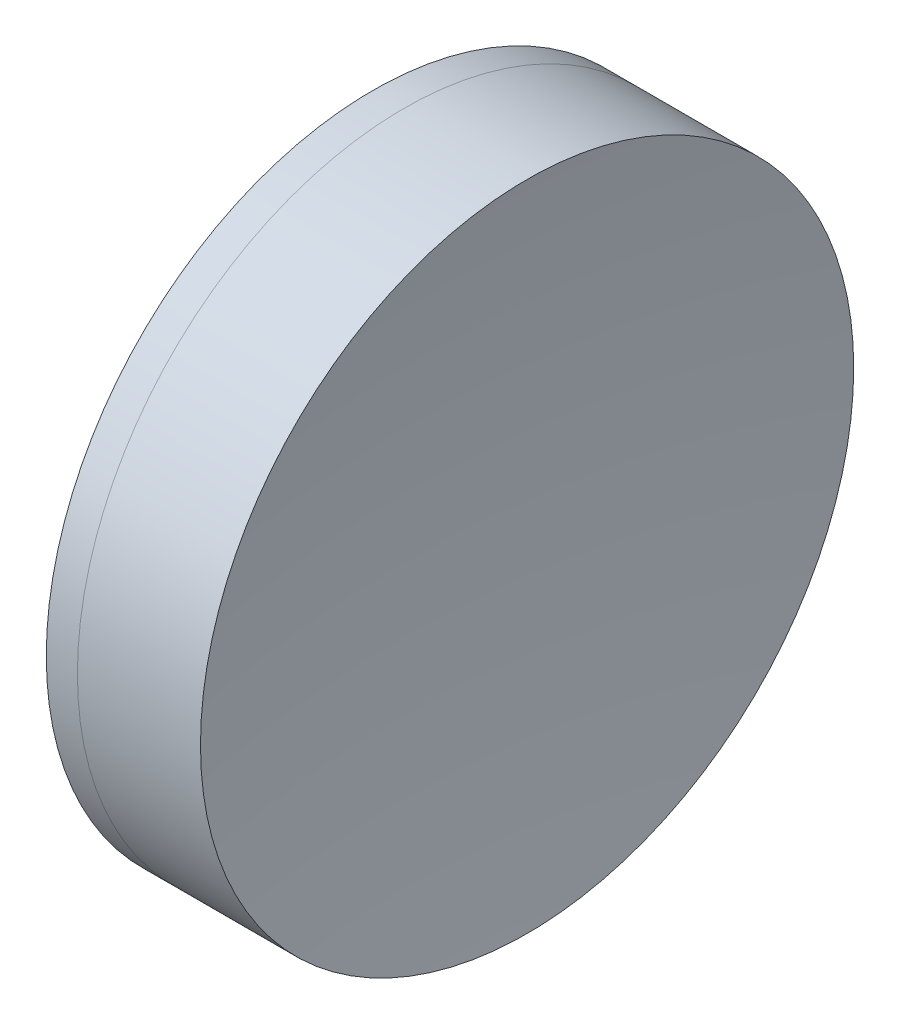
ISO-10303-21;
HEADER;
FILE_DESCRIPTION(('STEP AP214'),'2;1');
FILE_NAME('part.step','',(''),(''),'','','');
FILE_SCHEMA(('AUTOMOTIVE_DESIGN { 1 0 10303 214 1 1 1 1 }'));
ENDSEC;
DATA;
#1=APPLICATION_CONTEXT('core data for automotive mechanical design processes');
#2=APPLICATION_PROTOCOL_DEFINITION('international standard','automotive_design',2000,#1);
#3=PRODUCT_CONTEXT('',#1,'mechanical');
#4=PRODUCT('Part','Part','',(#3));
#5=PRODUCT_RELATED_PRODUCT_CATEGORY('part','',(#4));
#6=PRODUCT_DEFINITION_FORMATION('','',#4);
#7=PRODUCT_DEFINITION_CONTEXT('part definition',#1,'design');
#8=PRODUCT_DEFINITION('design','',#6,#7);
#9=PRODUCT_DEFINITION_SHAPE('','',#8);
#10=(LENGTH_UNIT() NAMED_UNIT(*) SI_UNIT(.MILLI.,.METRE.));
#11=(NAMED_UNIT(*) PLANE_ANGLE_UNIT() SI_UNIT($,.RADIAN.));
#12=(NAMED_UNIT(*) SI_UNIT($,.STERADIAN.) SOLID_ANGLE_UNIT());
#13=UNCERTAINTY_MEASURE_WITH_UNIT(LENGTH_MEASURE(1.E-05),#10,'distance_accuracy_value','');
#14=(GEOMETRIC_REPRESENTATION_CONTEXT(3) GLOBAL_UNCERTAINTY_ASSIGNED_CONTEXT((#13)) GLOBAL_UNIT_ASSIGNED_CONTEXT((#10,
#11,#12)) REPRESENTATION_CONTEXT('',''));
#15=CARTESIAN_POINT('',(0.,0.,0.));
#16=DIRECTION('',(0.,0.,1.));
#17=DIRECTION('',(1.,0.,0.));
#18=AXIS2_PLACEMENT_3D('',#15,#16,#17);
#19=CARTESIAN_POINT('',(2.72415925380743,0.,0.));
#20=DIRECTION('',(-1.,0.,0.));
#21=DIRECTION('',(0.,0.,1.));
#22=AXIS2_PLACEMENT_3D('',#19,#20,#21);
#23=SPHERICAL_SURFACE('',#22,57.6800000000002);
#24=CARTESIAN_POINT('',(58.9886453884912,0.,0.));
#25=DIRECTION('',(-1.,0.,0.));
#26=DIRECTION('',(0.,0.,1.));
#27=AXIS2_PLACEMENT_3D('',#24,#25,#26);
#28=CIRCLE('',#27,12.7);
#29=CARTESIAN_POINT('',(58.9886453884912,0.,12.7));
#30=VERTEX_POINT('',#29);
#31=EDGE_CURVE('E51',#30,#30,#28,.T.);
#32=ORIENTED_EDGE('',*,*,#31,.T.);
#33=EDGE_LOOP('',(#32));
#34=FACE_BOUND('',#33,.T.);
#35=ADVANCED_FACE('F45',(#34),#23,.F.);
#36=CARTESIAN_POINT('',(156.014159253808,0.,0.));
#37=DIRECTION('',(-1.,0.,0.));
#38=DIRECTION('',(0.,0.,-1.));
#39=AXIS2_PLACEMENT_3D('',#36,#37,#38);
#40=SPHERICAL_SURFACE('',#39,93.11);
#41=CARTESIAN_POINT('',(63.7743516867924,0.,0.));
#42=DIRECTION('',(-1.,0.,0.));
#43=DIRECTION('',(0.,0.,1.));
#44=AXIS2_PLACEMENT_3D('',#41,#42,#43);
#45=CIRCLE('',#44,12.7);
#46=CARTESIAN_POINT('',(63.7743516867924,0.,12.7));
#47=VERTEX_POINT('',#46);
#48=EDGE_CURVE('E11',#47,#47,#45,.T.);
#49=ORIENTED_EDGE('',*,*,#48,.F.);
#50=EDGE_LOOP('',(#49));
#51=FACE_BOUND('',#50,.T.);
#52=ADVANCED_FACE('F60',(#51),#40,.F.);
#53=CARTESIAN_POINT('',(-0.551919992657797,0.,0.));
#54=DIRECTION('',(-1.,0.,0.));
#55=DIRECTION('',(0.,0.,1.));
#56=AXIS2_PLACEMENT_3D('',#53,#54,#55);
#57=CYLINDRICAL_SURFACE('',#56,12.7);
#58=ORIENTED_EDGE('',*,*,#48,.T.);
#59=EDGE_LOOP('',(#58));
#60=FACE_BOUND('',#59,.T.);
#61=ORIENTED_EDGE('',*,*,#31,.F.);
#62=EDGE_LOOP('',(#61));
#63=FACE_BOUND('',#62,.T.);
#64=ADVANCED_FACE('F58',(#60,#63),#57,.T.);
#65=CLOSED_SHELL('',(#35,#52,#64));
#66=MANIFOLD_SOLID_BREP('B2',#65);
#67=CARTESIAN_POINT('',(99.8541592538074,0.,0.));
#68=DIRECTION('',(-1.,0.,0.));
#69=DIRECTION('',(0.,0.,-1.));
#70=AXIS2_PLACEMENT_3D('',#67,#68,#69);
#71=SPHERICAL_SURFACE('',#70,43.95);
#72=CARTESIAN_POINT('',(57.7790775545403,0.,0.));
#73=DIRECTION('',(-1.,0.,0.));
#74=DIRECTION('',(0.,0.,1.));
#75=AXIS2_PLACEMENT_3D('',#72,#73,#74);
#76=CIRCLE('',#75,12.7);
#77=CARTESIAN_POINT('',(57.7790775545403,0.,12.7));
#78=VERTEX_POINT('',#77);
#79=EDGE_CURVE('E44',#78,#78,#76,.T.);
#80=ORIENTED_EDGE('',*,*,#79,.T.);
#81=EDGE_LOOP('',(#80));
#82=FACE_BOUND('',#81,.T.);
#83=ADVANCED_FACE('F86',(#82),#71,.T.);
#84=CARTESIAN_POINT('',(-0.816062176165804,0.,0.));
#85=DIRECTION('',(-1.,0.,0.));
#86=DIRECTION('',(0.,0.,1.));
#87=AXIS2_PLACEMENT_3D('',#84,#85,#86);
#88=CYLINDRICAL_SURFACE('',#87,12.7);
#89=CARTESIAN_POINT('',(58.9886453884912,0.,0.));
#90=DIRECTION('',(-1.,0.,0.));
#91=DIRECTION('',(0.,0.,1.));
#92=AXIS2_PLACEMENT_3D('',#89,#90,#91);
#93=CIRCLE('',#92,12.7);
#94=CARTESIAN_POINT('',(58.9886453884912,0.,12.7));
#95=VERTEX_POINT('',#94);
#96=EDGE_CURVE('E92',#95,#95,#93,.T.);
#97=ORIENTED_EDGE('',*,*,#96,.T.);
#98=EDGE_LOOP('',(#97));
#99=FACE_BOUND('',#98,.T.);
#100=ORIENTED_EDGE('',*,*,#79,.F.);
#101=EDGE_LOOP('',(#100));
#102=FACE_BOUND('',#101,.T.);
#103=ADVANCED_FACE('F98',(#99,#102),#88,.T.);
#104=CARTESIAN_POINT('',(2.72415925380743,0.,0.));
#105=DIRECTION('',(-1.,0.,0.));
#106=DIRECTION('',(0.,0.,1.));
#107=AXIS2_PLACEMENT_3D('',#104,#105,#106);
#108=SPHERICAL_SURFACE('',#107,57.6800000000002);
#109=ORIENTED_EDGE('',*,*,#96,.F.);
#110=EDGE_LOOP('',(#109));
#111=FACE_BOUND('',#110,.T.);
#112=ADVANCED_FACE('F101',(#111),#108,.T.);
#113=CLOSED_SHELL('',(#83,#103,#112));
#114=MANIFOLD_SOLID_BREP('B6',#113);
#115=ADVANCED_BREP_SHAPE_REPRESENTATION('',(#18,#66,#114),#14);
#116=SHAPE_DEFINITION_REPRESENTATION(#9,#115);
ENDSEC;
END-ISO-10303-21;
